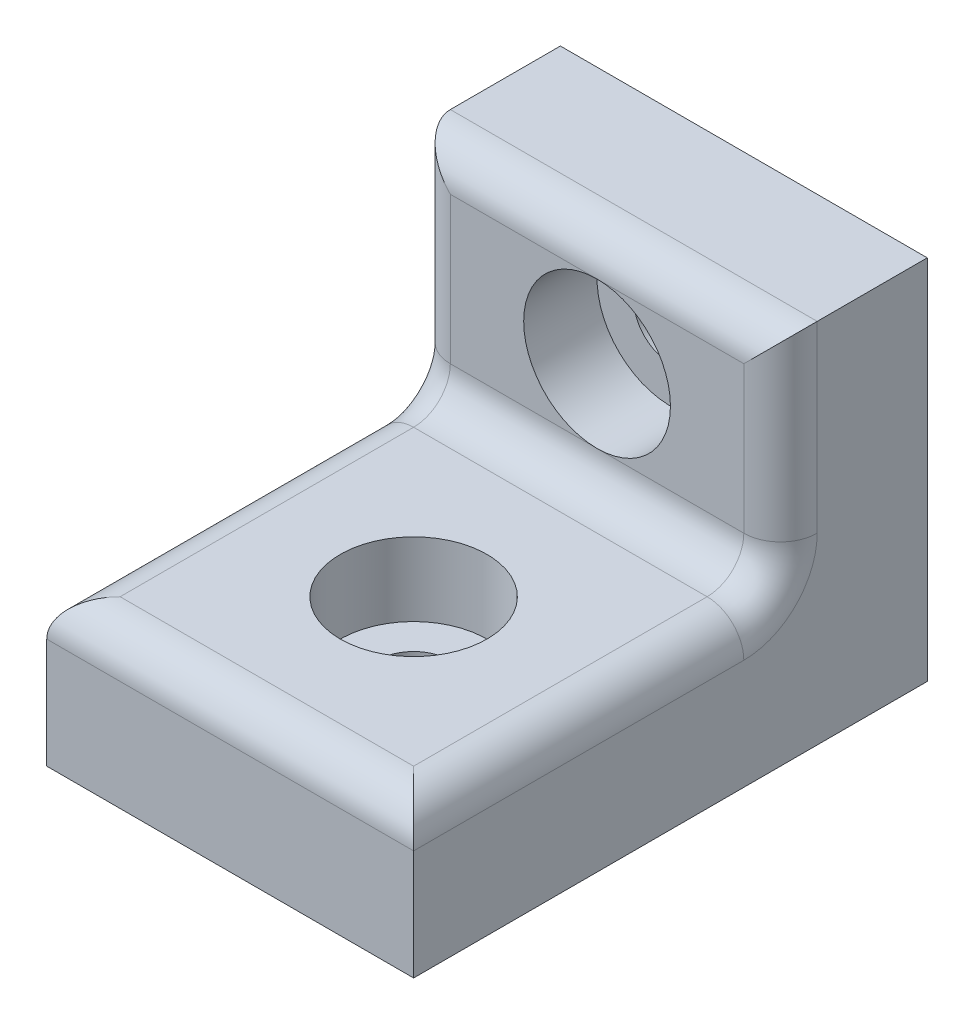
ISO-10303-21;
HEADER;
FILE_DESCRIPTION(('STEP AP214'),'2;1');
FILE_NAME('part.step','',(''),(''),'','','');
FILE_SCHEMA(('AUTOMOTIVE_DESIGN { 1 0 10303 214 1 1 1 1 }'));
ENDSEC;
DATA;
#1=APPLICATION_CONTEXT('core data for automotive mechanical design processes');
#2=APPLICATION_PROTOCOL_DEFINITION('international standard','automotive_design',2000,#1);
#3=PRODUCT_CONTEXT('',#1,'mechanical');
#4=PRODUCT('Part','Part','',(#3));
#5=PRODUCT_RELATED_PRODUCT_CATEGORY('part','',(#4));
#6=PRODUCT_DEFINITION_FORMATION('','',#4);
#7=PRODUCT_DEFINITION_CONTEXT('part definition',#1,'design');
#8=PRODUCT_DEFINITION('design','',#6,#7);
#9=PRODUCT_DEFINITION_SHAPE('','',#8);
#10=(LENGTH_UNIT() NAMED_UNIT(*) SI_UNIT(.MILLI.,.METRE.));
#11=(NAMED_UNIT(*) PLANE_ANGLE_UNIT() SI_UNIT($,.RADIAN.));
#12=(NAMED_UNIT(*) SI_UNIT($,.STERADIAN.) SOLID_ANGLE_UNIT());
#13=UNCERTAINTY_MEASURE_WITH_UNIT(LENGTH_MEASURE(1.E-05),#10,'distance_accuracy_value','');
#14=(GEOMETRIC_REPRESENTATION_CONTEXT(3) GLOBAL_UNCERTAINTY_ASSIGNED_CONTEXT((#13)) GLOBAL_UNIT_ASSIGNED_CONTEXT((#10,
#11,#12)) REPRESENTATION_CONTEXT('',''));
#15=CARTESIAN_POINT('',(0.,0.,0.));
#16=DIRECTION('',(0.,0.,1.));
#17=DIRECTION('',(1.,0.,0.));
#18=AXIS2_PLACEMENT_3D('',#15,#16,#17);
#19=CARTESIAN_POINT('',(0.,0.,9.));
#20=DIRECTION('',(0.,1.,0.));
#21=DIRECTION('',(0.,0.,1.));
#22=AXIS2_PLACEMENT_3D('',#19,#20,#21);
#23=CYLINDRICAL_SURFACE('',#22,1.);
#24=CARTESIAN_POINT('',(0.,0.,9.));
#25=DIRECTION('',(0.,1.,0.));
#26=DIRECTION('',(0.,0.,1.));
#27=AXIS2_PLACEMENT_3D('',#24,#25,#26);
#28=CIRCLE('',#27,1.);
#29=CARTESIAN_POINT('',(0.,0.,10.));
#30=VERTEX_POINT('',#29);
#31=EDGE_CURVE('E184',#30,#30,#28,.T.);
#32=ORIENTED_EDGE('',*,*,#31,.F.);
#33=EDGE_LOOP('',(#32));
#34=FACE_BOUND('',#33,.T.);
#35=CARTESIAN_POINT('',(0.,2.,9.));
#36=DIRECTION('',(0.,1.,0.));
#37=DIRECTION('',(0.,0.,1.));
#38=AXIS2_PLACEMENT_3D('',#35,#36,#37);
#39=CIRCLE('',#38,1.);
#40=CARTESIAN_POINT('',(0.,2.,10.));
#41=VERTEX_POINT('',#40);
#42=EDGE_CURVE('E41',#41,#41,#39,.F.);
#43=ORIENTED_EDGE('',*,*,#42,.F.);
#44=EDGE_LOOP('',(#43));
#45=FACE_BOUND('',#44,.T.);
#46=ADVANCED_FACE('F37',(#34,#45),#23,.F.);
#47=CARTESIAN_POINT('',(0.,0.,4.));
#48=DIRECTION('',(0.,0.,1.));
#49=DIRECTION('',(1.,0.,0.));
#50=AXIS2_PLACEMENT_3D('',#47,#48,#49);
#51=PLANE('',#50);
#52=CARTESIAN_POINT('',(0.,7.,4.));
#53=DIRECTION('',(0.,0.,1.));
#54=DIRECTION('',(1.,0.,0.));
#55=AXIS2_PLACEMENT_3D('',#52,#53,#54);
#56=CIRCLE('',#55,2.);
#57=CARTESIAN_POINT('',(0.,9.,4.));
#58=VERTEX_POINT('',#57);
#59=CARTESIAN_POINT('',(0.,5.,4.));
#60=VERTEX_POINT('',#59);
#61=EDGE_CURVE('E53',#58,#60,#56,.T.);
#62=ORIENTED_EDGE('',*,*,#61,.F.);
#63=DIRECTION('',(-1.,0.,0.));
#64=VECTOR('',#63,1.);
#65=CARTESIAN_POINT('',(-5.,9.,4.));
#66=LINE('',#65,#64);
#67=CARTESIAN_POINT('',(-4.,9.,4.));
#68=VERTEX_POINT('',#67);
#69=EDGE_CURVE('E135',#58,#68,#66,.T.);
#70=ORIENTED_EDGE('',*,*,#69,.T.);
#71=DIRECTION('',(0.,-1.,0.));
#72=VECTOR('',#71,1.);
#73=CARTESIAN_POINT('',(-4.,4.,4.));
#74=LINE('',#73,#72);
#75=CARTESIAN_POINT('',(-4.,5.,4.));
#76=VERTEX_POINT('',#75);
#77=EDGE_CURVE('E253',#68,#76,#74,.T.);
#78=ORIENTED_EDGE('',*,*,#77,.T.);
#79=DIRECTION('',(-1.,0.,0.));
#80=VECTOR('',#79,1.);
#81=CARTESIAN_POINT('',(0.,5.,4.));
#82=LINE('',#81,#80);
#83=EDGE_CURVE('E138',#76,#60,#82,.F.);
#84=ORIENTED_EDGE('',*,*,#83,.T.);
#85=EDGE_LOOP('',(#62,#70,#78,#84));
#86=FACE_BOUND('',#85,.T.);
#87=ADVANCED_FACE('F134',(#86),#51,.T.);
#88=CARTESIAN_POINT('',(0.,7.,0.));
#89=DIRECTION('',(0.,0.,1.));
#90=DIRECTION('',(1.,0.,0.));
#91=AXIS2_PLACEMENT_3D('',#88,#89,#90);
#92=CYLINDRICAL_SURFACE('',#91,1.);
#93=CARTESIAN_POINT('',(0.,7.,0.));
#94=DIRECTION('',(0.,0.,1.));
#95=DIRECTION('',(1.,0.,0.));
#96=AXIS2_PLACEMENT_3D('',#93,#94,#95);
#97=CIRCLE('',#96,1.);
#98=CARTESIAN_POINT('',(1.,7.,0.));
#99=VERTEX_POINT('',#98);
#100=EDGE_CURVE('E206',#99,#99,#97,.T.);
#101=ORIENTED_EDGE('',*,*,#100,.F.);
#102=EDGE_LOOP('',(#101));
#103=FACE_BOUND('',#102,.T.);
#104=CARTESIAN_POINT('',(0.,7.,2.));
#105=DIRECTION('',(0.,0.,1.));
#106=DIRECTION('',(1.,0.,0.));
#107=AXIS2_PLACEMENT_3D('',#104,#105,#106);
#108=CIRCLE('',#107,1.);
#109=CARTESIAN_POINT('',(1.,7.,2.));
#110=VERTEX_POINT('',#109);
#111=EDGE_CURVE('E207',#110,#110,#108,.F.);
#112=ORIENTED_EDGE('',*,*,#111,.F.);
#113=EDGE_LOOP('',(#112));
#114=FACE_BOUND('',#113,.T.);
#115=ADVANCED_FACE('F313',(#103,#114),#92,.F.);
#116=CARTESIAN_POINT('',(-5.,10.,4.));
#117=DIRECTION('',(1.,0.,0.));
#118=DIRECTION('',(0.,1.,0.));
#119=AXIS2_PLACEMENT_3D('',#116,#117,#118);
#120=PLANE('',#119);
#121=CARTESIAN_POINT('',(-5.,5.,5.));
#122=DIRECTION('',(1.,0.,0.));
#123=DIRECTION('',(0.,1.,0.));
#124=AXIS2_PLACEMENT_3D('',#121,#122,#123);
#125=CIRCLE('',#124,2.);
#126=CARTESIAN_POINT('',(-5.,5.,3.));
#127=VERTEX_POINT('',#126);
#128=CARTESIAN_POINT('',(-5.,3.,5.));
#129=VERTEX_POINT('',#128);
#130=EDGE_CURVE('E165',#127,#129,#125,.F.);
#131=ORIENTED_EDGE('',*,*,#130,.F.);
#132=DIRECTION('',(0.,-1.,0.));
#133=VECTOR('',#132,1.);
#134=CARTESIAN_POINT('',(-5.,10.,3.));
#135=LINE('',#134,#133);
#136=CARTESIAN_POINT('',(-5.,10.,3.));
#137=VERTEX_POINT('',#136);
#138=EDGE_CURVE('E170',#127,#137,#135,.F.);
#139=ORIENTED_EDGE('',*,*,#138,.T.);
#140=DIRECTION('',(0.,0.,-1.));
#141=VECTOR('',#140,1.);
#142=CARTESIAN_POINT('',(-5.,10.,4.));
#143=LINE('',#142,#141);
#144=CARTESIAN_POINT('',(-5.,10.,0.));
#145=VERTEX_POINT('',#144);
#146=EDGE_CURVE('E242',#137,#145,#143,.T.);
#147=ORIENTED_EDGE('',*,*,#146,.T.);
#148=DIRECTION('',(0.,-1.,0.));
#149=VECTOR('',#148,1.);
#150=CARTESIAN_POINT('',(-5.,10.,0.));
#151=LINE('',#150,#149);
#152=CARTESIAN_POINT('',(-5.,0.,0.));
#153=VERTEX_POINT('',#152);
#154=EDGE_CURVE('E231',#145,#153,#151,.T.);
#155=ORIENTED_EDGE('',*,*,#154,.T.);
#156=DIRECTION('',(0.,0.,-1.));
#157=VECTOR('',#156,1.);
#158=CARTESIAN_POINT('',(-5.,0.,4.));
#159=LINE('',#158,#157);
#160=CARTESIAN_POINT('',(-5.,0.,14.));
#161=VERTEX_POINT('',#160);
#162=EDGE_CURVE('E249',#161,#153,#159,.T.);
#163=ORIENTED_EDGE('',*,*,#162,.F.);
#164=DIRECTION('',(0.,-1.,0.));
#165=VECTOR('',#164,1.);
#166=CARTESIAN_POINT('',(-5.,0.,14.));
#167=LINE('',#166,#165);
#168=CARTESIAN_POINT('',(-5.,3.,14.));
#169=VERTEX_POINT('',#168);
#170=EDGE_CURVE('E223',#169,#161,#167,.T.);
#171=ORIENTED_EDGE('',*,*,#170,.F.);
#172=DIRECTION('',(0.,0.,-1.));
#173=VECTOR('',#172,1.);
#174=CARTESIAN_POINT('',(-5.,3.,4.));
#175=LINE('',#174,#173);
#176=EDGE_CURVE('E168',#169,#129,#175,.T.);
#177=ORIENTED_EDGE('',*,*,#176,.T.);
#178=EDGE_LOOP('',(#131,#139,#147,#155,#163,#171,#177));
#179=FACE_BOUND('',#178,.T.);
#180=ADVANCED_FACE('F286',(#179),#120,.F.);
#181=CARTESIAN_POINT('',(-5.,0.,4.));
#182=DIRECTION('',(0.,1.,0.));
#183=DIRECTION('',(0.,0.,1.));
#184=AXIS2_PLACEMENT_3D('',#181,#182,#183);
#185=PLANE('',#184);
#186=ORIENTED_EDGE('',*,*,#31,.T.);
#187=EDGE_LOOP('',(#186));
#188=FACE_BOUND('',#187,.T.);
#189=DIRECTION('',(1.,0.,0.));
#190=VECTOR('',#189,1.);
#191=CARTESIAN_POINT('',(-5.,0.,0.));
#192=LINE('',#191,#190);
#193=CARTESIAN_POINT('',(5.,0.,0.));
#194=VERTEX_POINT('',#193);
#195=EDGE_CURVE('E234',#153,#194,#192,.T.);
#196=ORIENTED_EDGE('',*,*,#195,.T.);
#197=DIRECTION('',(0.,0.,-1.));
#198=VECTOR('',#197,1.);
#199=CARTESIAN_POINT('',(5.,0.,4.));
#200=LINE('',#199,#198);
#201=CARTESIAN_POINT('',(5.,0.,14.));
#202=VERTEX_POINT('',#201);
#203=EDGE_CURVE('E246',#202,#194,#200,.T.);
#204=ORIENTED_EDGE('',*,*,#203,.F.);
#205=DIRECTION('',(1.,0.,0.));
#206=VECTOR('',#205,1.);
#207=CARTESIAN_POINT('',(-5.,0.,14.));
#208=LINE('',#207,#206);
#209=EDGE_CURVE('E225',#161,#202,#208,.T.);
#210=ORIENTED_EDGE('',*,*,#209,.F.);
#211=ORIENTED_EDGE('',*,*,#162,.T.);
#212=EDGE_LOOP('',(#196,#204,#210,#211));
#213=FACE_BOUND('',#212,.T.);
#214=ADVANCED_FACE('F304',(#188,#213),#185,.F.);
#215=CARTESIAN_POINT('',(5.,10.,4.));
#216=DIRECTION('',(-1.,0.,0.));
#217=DIRECTION('',(0.,-1.,0.));
#218=AXIS2_PLACEMENT_3D('',#215,#216,#217);
#219=PLANE('',#218);
#220=DIRECTION('',(0.,0.,-1.));
#221=VECTOR('',#220,1.);
#222=CARTESIAN_POINT('',(5.,10.,4.));
#223=LINE('',#222,#221);
#224=CARTESIAN_POINT('',(5.,10.,3.));
#225=VERTEX_POINT('',#224);
#226=CARTESIAN_POINT('',(5.,10.,0.));
#227=VERTEX_POINT('',#226);
#228=EDGE_CURVE('E244',#225,#227,#223,.T.);
#229=ORIENTED_EDGE('',*,*,#228,.F.);
#230=DIRECTION('',(0.,1.,0.));
#231=VECTOR('',#230,1.);
#232=CARTESIAN_POINT('',(5.,4.,3.));
#233=LINE('',#232,#231);
#234=CARTESIAN_POINT('',(5.,5.,3.));
#235=VERTEX_POINT('',#234);
#236=EDGE_CURVE('E162',#225,#235,#233,.F.);
#237=ORIENTED_EDGE('',*,*,#236,.T.);
#238=CARTESIAN_POINT('',(5.,5.,5.));
#239=DIRECTION('',(-1.,0.,0.));
#240=DIRECTION('',(0.,-1.,0.));
#241=AXIS2_PLACEMENT_3D('',#238,#239,#240);
#242=CIRCLE('',#241,2.);
#243=CARTESIAN_POINT('',(5.,3.,5.));
#244=VERTEX_POINT('',#243);
#245=EDGE_CURVE('E155',#244,#235,#242,.F.);
#246=ORIENTED_EDGE('',*,*,#245,.F.);
#247=DIRECTION('',(0.,0.,-1.));
#248=VECTOR('',#247,1.);
#249=CARTESIAN_POINT('',(5.,3.,4.));
#250=LINE('',#249,#248);
#251=CARTESIAN_POINT('',(5.,3.,14.));
#252=VERTEX_POINT('',#251);
#253=EDGE_CURVE('E154',#244,#252,#250,.F.);
#254=ORIENTED_EDGE('',*,*,#253,.T.);
#255=DIRECTION('',(0.,1.,0.));
#256=VECTOR('',#255,1.);
#257=CARTESIAN_POINT('',(5.,0.,14.));
#258=LINE('',#257,#256);
#259=EDGE_CURVE('E228',#202,#252,#258,.T.);
#260=ORIENTED_EDGE('',*,*,#259,.F.);
#261=ORIENTED_EDGE('',*,*,#203,.T.);
#262=DIRECTION('',(0.,1.,0.));
#263=VECTOR('',#262,1.);
#264=CARTESIAN_POINT('',(5.,10.,0.));
#265=LINE('',#264,#263);
#266=EDGE_CURVE('E236',#194,#227,#265,.T.);
#267=ORIENTED_EDGE('',*,*,#266,.T.);
#268=EDGE_LOOP('',(#229,#237,#246,#254,#260,#261,#267));
#269=FACE_BOUND('',#268,.T.);
#270=ADVANCED_FACE('F277',(#269),#219,.F.);
#271=CARTESIAN_POINT('',(-5.,10.,4.));
#272=DIRECTION('',(0.,-1.,0.));
#273=DIRECTION('',(0.,0.,-1.));
#274=AXIS2_PLACEMENT_3D('',#271,#272,#273);
#275=PLANE('',#274);
#276=ORIENTED_EDGE('',*,*,#146,.F.);
#277=DIRECTION('',(-1.,0.,0.));
#278=VECTOR('',#277,1.);
#279=CARTESIAN_POINT('',(5.,10.,3.));
#280=LINE('',#279,#278);
#281=EDGE_CURVE('E12',#137,#225,#280,.F.);
#282=ORIENTED_EDGE('',*,*,#281,.T.);
#283=ORIENTED_EDGE('',*,*,#228,.T.);
#284=DIRECTION('',(-1.,0.,0.));
#285=VECTOR('',#284,1.);
#286=CARTESIAN_POINT('',(-5.,10.,0.));
#287=LINE('',#286,#285);
#288=EDGE_CURVE('E239',#227,#145,#287,.T.);
#289=ORIENTED_EDGE('',*,*,#288,.T.);
#290=EDGE_LOOP('',(#276,#282,#283,#289));
#291=FACE_BOUND('',#290,.T.);
#292=ADVANCED_FACE('F275',(#291),#275,.F.);
#293=EDGE_CURVE('E125',#60,#58,#56,.T.);
#294=ORIENTED_EDGE('',*,*,#293,.F.);
#295=CARTESIAN_POINT('',(4.,5.,4.));
#296=VERTEX_POINT('',#295);
#297=EDGE_CURVE('E252',#60,#296,#82,.F.);
#298=ORIENTED_EDGE('',*,*,#297,.T.);
#299=DIRECTION('',(0.,1.,0.));
#300=VECTOR('',#299,1.);
#301=CARTESIAN_POINT('',(4.,10.,4.));
#302=LINE('',#301,#300);
#303=CARTESIAN_POINT('',(4.,9.,4.));
#304=VERTEX_POINT('',#303);
#305=EDGE_CURVE('E150',#296,#304,#302,.T.);
#306=ORIENTED_EDGE('',*,*,#305,.T.);
#307=EDGE_CURVE('E145',#304,#58,#66,.T.);
#308=ORIENTED_EDGE('',*,*,#307,.T.);
#309=EDGE_LOOP('',(#294,#298,#306,#308));
#310=FACE_BOUND('',#309,.T.);
#311=ADVANCED_FACE('F152',(#310),#51,.T.);
#312=CARTESIAN_POINT('',(0.,0.,0.));
#313=DIRECTION('',(0.,0.,1.));
#314=DIRECTION('',(1.,0.,0.));
#315=AXIS2_PLACEMENT_3D('',#312,#313,#314);
#316=PLANE('',#315);
#317=ORIENTED_EDGE('',*,*,#100,.T.);
#318=EDGE_LOOP('',(#317));
#319=FACE_BOUND('',#318,.T.);
#320=ORIENTED_EDGE('',*,*,#154,.F.);
#321=ORIENTED_EDGE('',*,*,#288,.F.);
#322=ORIENTED_EDGE('',*,*,#266,.F.);
#323=ORIENTED_EDGE('',*,*,#195,.F.);
#324=EDGE_LOOP('',(#320,#321,#322,#323));
#325=FACE_BOUND('',#324,.T.);
#326=ADVANCED_FACE('F283',(#319,#325),#316,.F.);
#327=CARTESIAN_POINT('',(-5.,4.,14.));
#328=DIRECTION('',(0.,-1.,0.));
#329=DIRECTION('',(0.,0.,-1.));
#330=AXIS2_PLACEMENT_3D('',#327,#328,#329);
#331=PLANE('',#330);
#332=CARTESIAN_POINT('',(0.,4.,9.));
#333=DIRECTION('',(0.,1.,0.));
#334=DIRECTION('',(0.,0.,1.));
#335=AXIS2_PLACEMENT_3D('',#332,#333,#334);
#336=CIRCLE('',#335,2.);
#337=CARTESIAN_POINT('',(0.,4.,11.));
#338=VERTEX_POINT('',#337);
#339=EDGE_CURVE('E218',#338,#338,#336,.T.);
#340=ORIENTED_EDGE('',*,*,#339,.F.);
#341=EDGE_LOOP('',(#340));
#342=FACE_BOUND('',#341,.T.);
#343=DIRECTION('',(0.,0.,-1.));
#344=VECTOR('',#343,1.);
#345=CARTESIAN_POINT('',(-4.,4.,14.));
#346=LINE('',#345,#344);
#347=CARTESIAN_POINT('',(-4.,4.,5.));
#348=VERTEX_POINT('',#347);
#349=CARTESIAN_POINT('',(-4.,4.,13.));
#350=VERTEX_POINT('',#349);
#351=EDGE_CURVE('E176',#348,#350,#346,.F.);
#352=ORIENTED_EDGE('',*,*,#351,.T.);
#353=DIRECTION('',(-1.,0.,0.));
#354=VECTOR('',#353,1.);
#355=CARTESIAN_POINT('',(-5.,4.,13.));
#356=LINE('',#355,#354);
#357=CARTESIAN_POINT('',(4.,4.,13.));
#358=VERTEX_POINT('',#357);
#359=EDGE_CURVE('E46',#350,#358,#356,.F.);
#360=ORIENTED_EDGE('',*,*,#359,.T.);
#361=DIRECTION('',(0.,0.,-1.));
#362=VECTOR('',#361,1.);
#363=CARTESIAN_POINT('',(4.,4.,14.));
#364=LINE('',#363,#362);
#365=CARTESIAN_POINT('',(4.,4.,5.));
#366=VERTEX_POINT('',#365);
#367=EDGE_CURVE('E61',#358,#366,#364,.T.);
#368=ORIENTED_EDGE('',*,*,#367,.T.);
#369=DIRECTION('',(-1.,0.,0.));
#370=VECTOR('',#369,1.);
#371=CARTESIAN_POINT('',(-5.,4.,5.));
#372=LINE('',#371,#370);
#373=EDGE_CURVE('E174',#366,#348,#372,.T.);
#374=ORIENTED_EDGE('',*,*,#373,.T.);
#375=EDGE_LOOP('',(#352,#360,#368,#374));
#376=FACE_BOUND('',#375,.T.);
#377=ADVANCED_FACE('F295',(#342,#376),#331,.F.);
#378=CARTESIAN_POINT('',(0.,0.,14.));
#379=DIRECTION('',(0.,0.,-1.));
#380=DIRECTION('',(-1.,0.,0.));
#381=AXIS2_PLACEMENT_3D('',#378,#379,#380);
#382=PLANE('',#381);
#383=ORIENTED_EDGE('',*,*,#259,.T.);
#384=DIRECTION('',(-1.,0.,0.));
#385=VECTOR('',#384,1.);
#386=CARTESIAN_POINT('',(0.,3.,14.));
#387=LINE('',#386,#385);
#388=EDGE_CURVE('E172',#252,#169,#387,.T.);
#389=ORIENTED_EDGE('',*,*,#388,.T.);
#390=ORIENTED_EDGE('',*,*,#170,.T.);
#391=ORIENTED_EDGE('',*,*,#209,.T.);
#392=EDGE_LOOP('',(#383,#389,#390,#391));
#393=FACE_BOUND('',#392,.T.);
#394=ADVANCED_FACE('F302',(#393),#382,.F.);
#395=CARTESIAN_POINT('',(-4.,3.,4.));
#396=DIRECTION('',(0.,0.,-1.));
#397=DIRECTION('',(-1.,0.,0.));
#398=AXIS2_PLACEMENT_3D('',#395,#396,#397);
#399=CYLINDRICAL_SURFACE('',#398,1.);
#400=CARTESIAN_POINT('',(-4.,3.,5.));
#401=DIRECTION('',(0.,0.,-1.));
#402=DIRECTION('',(-1.,0.,0.));
#403=AXIS2_PLACEMENT_3D('',#400,#401,#402);
#404=CIRCLE('',#403,1.);
#405=EDGE_CURVE('E201',#129,#348,#404,.T.);
#406=ORIENTED_EDGE('',*,*,#405,.F.);
#407=ORIENTED_EDGE('',*,*,#176,.F.);
#408=CARTESIAN_POINT('',(-4.,3.,13.));
#409=DIRECTION('',(-0.707106781186547,0.,-0.707106781186547));
#410=DIRECTION('',(0.707106781186547,0.,-0.707106781186547));
#411=AXIS2_PLACEMENT_3D('',#408,#409,#410);
#412=ELLIPSE('',#411,1.41421356237309,1.);
#413=EDGE_CURVE('E204',#350,#169,#412,.F.);
#414=ORIENTED_EDGE('',*,*,#413,.F.);
#415=ORIENTED_EDGE('',*,*,#351,.F.);
#416=EDGE_LOOP('',(#406,#407,#414,#415));
#417=FACE_BOUND('',#416,.T.);
#418=ADVANCED_FACE('F39',(#417),#399,.T.);
#419=CARTESIAN_POINT('',(0.,3.,13.));
#420=DIRECTION('',(-1.,0.,0.));
#421=DIRECTION('',(0.,0.,1.));
#422=AXIS2_PLACEMENT_3D('',#419,#420,#421);
#423=CYLINDRICAL_SURFACE('',#422,1.);
#424=ORIENTED_EDGE('',*,*,#413,.T.);
#425=ORIENTED_EDGE('',*,*,#388,.F.);
#426=CARTESIAN_POINT('',(4.,3.,13.));
#427=DIRECTION('',(0.707106781186547,0.,-0.707106781186547));
#428=DIRECTION('',(-0.707106781186547,0.,-0.707106781186547));
#429=AXIS2_PLACEMENT_3D('',#426,#427,#428);
#430=ELLIPSE('',#429,1.41421356237309,1.);
#431=EDGE_CURVE('E199',#358,#252,#430,.T.);
#432=ORIENTED_EDGE('',*,*,#431,.F.);
#433=ORIENTED_EDGE('',*,*,#359,.F.);
#434=EDGE_LOOP('',(#424,#425,#432,#433));
#435=FACE_BOUND('',#434,.T.);
#436=ADVANCED_FACE('F297',(#435),#423,.T.);
#437=CARTESIAN_POINT('',(-4.,5.,5.));
#438=DIRECTION('',(1.,0.,0.));
#439=DIRECTION('',(0.,1.,0.));
#440=AXIS2_PLACEMENT_3D('',#437,#438,#439);
#441=TOROIDAL_SURFACE('',#440,2.,1.);
#442=ORIENTED_EDGE('',*,*,#130,.T.);
#443=ORIENTED_EDGE('',*,*,#405,.T.);
#444=CARTESIAN_POINT('',(-4.,5.,5.));
#445=DIRECTION('',(1.,0.,0.));
#446=DIRECTION('',(0.,1.,0.));
#447=AXIS2_PLACEMENT_3D('',#444,#445,#446);
#448=CIRCLE('',#447,1.);
#449=EDGE_CURVE('E196',#76,#348,#448,.F.);
#450=ORIENTED_EDGE('',*,*,#449,.F.);
#451=CARTESIAN_POINT('',(-4.,5.,3.));
#452=DIRECTION('',(0.,-1.,0.));
#453=DIRECTION('',(0.,0.,-1.));
#454=AXIS2_PLACEMENT_3D('',#451,#452,#453);
#455=CIRCLE('',#454,1.);
#456=EDGE_CURVE('E193',#127,#76,#455,.F.);
#457=ORIENTED_EDGE('',*,*,#456,.F.);
#458=EDGE_LOOP('',(#442,#443,#450,#457));
#459=FACE_BOUND('',#458,.T.);
#460=ADVANCED_FACE('F260',(#459),#441,.T.);
#461=CARTESIAN_POINT('',(4.,3.,14.));
#462=DIRECTION('',(0.,0.,-1.));
#463=DIRECTION('',(-1.,0.,0.));
#464=AXIS2_PLACEMENT_3D('',#461,#462,#463);
#465=CYLINDRICAL_SURFACE('',#464,1.);
#466=ORIENTED_EDGE('',*,*,#431,.T.);
#467=ORIENTED_EDGE('',*,*,#253,.F.);
#468=CARTESIAN_POINT('',(4.,3.,5.));
#469=DIRECTION('',(0.,0.,-1.));
#470=DIRECTION('',(-1.,0.,0.));
#471=AXIS2_PLACEMENT_3D('',#468,#469,#470);
#472=CIRCLE('',#471,1.);
#473=EDGE_CURVE('E190',#366,#244,#472,.T.);
#474=ORIENTED_EDGE('',*,*,#473,.F.);
#475=ORIENTED_EDGE('',*,*,#367,.F.);
#476=EDGE_LOOP('',(#466,#467,#474,#475));
#477=FACE_BOUND('',#476,.T.);
#478=ADVANCED_FACE('F300',(#477),#465,.T.);
#479=CARTESIAN_POINT('',(-5.,5.,5.));
#480=DIRECTION('',(-1.,0.,0.));
#481=DIRECTION('',(0.,0.,1.));
#482=AXIS2_PLACEMENT_3D('',#479,#480,#481);
#483=CYLINDRICAL_SURFACE('',#482,1.);
#484=ORIENTED_EDGE('',*,*,#449,.T.);
#485=ORIENTED_EDGE('',*,*,#373,.F.);
#486=CARTESIAN_POINT('',(4.,5.,5.));
#487=DIRECTION('',(-1.,0.,0.));
#488=DIRECTION('',(0.,-1.,0.));
#489=AXIS2_PLACEMENT_3D('',#486,#487,#488);
#490=CIRCLE('',#489,1.);
#491=EDGE_CURVE('E187',#296,#366,#490,.T.);
#492=ORIENTED_EDGE('',*,*,#491,.F.);
#493=ORIENTED_EDGE('',*,*,#297,.F.);
#494=ORIENTED_EDGE('',*,*,#83,.F.);
#495=EDGE_LOOP('',(#484,#485,#492,#493,#494));
#496=FACE_BOUND('',#495,.T.);
#497=ADVANCED_FACE('F264',(#496),#483,.F.);
#498=CARTESIAN_POINT('',(-4.,0.,3.));
#499=DIRECTION('',(0.,1.,0.));
#500=DIRECTION('',(-1.,0.,0.));
#501=AXIS2_PLACEMENT_3D('',#498,#499,#500);
#502=CYLINDRICAL_SURFACE('',#501,1.);
#503=ORIENTED_EDGE('',*,*,#456,.T.);
#504=ORIENTED_EDGE('',*,*,#77,.F.);
#505=CARTESIAN_POINT('',(-4.,9.,3.));
#506=DIRECTION('',(0.707106781186547,0.707106781186548,0.));
#507=DIRECTION('',(0.707106781186548,-0.707106781186547,0.));
#508=AXIS2_PLACEMENT_3D('',#505,#506,#507);
#509=ELLIPSE('',#508,1.4142135623731,1.);
#510=EDGE_CURVE('E149',#137,#68,#509,.T.);
#511=ORIENTED_EDGE('',*,*,#510,.F.);
#512=ORIENTED_EDGE('',*,*,#138,.F.);
#513=EDGE_LOOP('',(#503,#504,#511,#512));
#514=FACE_BOUND('',#513,.T.);
#515=ADVANCED_FACE('F258',(#514),#502,.T.);
#516=CARTESIAN_POINT('',(4.,5.,5.));
#517=DIRECTION('',(-1.,0.,0.));
#518=DIRECTION('',(0.,-1.,0.));
#519=AXIS2_PLACEMENT_3D('',#516,#517,#518);
#520=TOROIDAL_SURFACE('',#519,2.,1.);
#521=ORIENTED_EDGE('',*,*,#473,.T.);
#522=ORIENTED_EDGE('',*,*,#245,.T.);
#523=CARTESIAN_POINT('',(4.,5.,3.));
#524=DIRECTION('',(0.,-1.,0.));
#525=DIRECTION('',(0.,0.,-1.));
#526=AXIS2_PLACEMENT_3D('',#523,#524,#525);
#527=CIRCLE('',#526,1.);
#528=EDGE_CURVE('E183',#296,#235,#527,.F.);
#529=ORIENTED_EDGE('',*,*,#528,.F.);
#530=ORIENTED_EDGE('',*,*,#491,.T.);
#531=EDGE_LOOP('',(#521,#522,#529,#530));
#532=FACE_BOUND('',#531,.T.);
#533=ADVANCED_FACE('F268',(#532),#520,.T.);
#534=CARTESIAN_POINT('',(0.,9.,3.));
#535=DIRECTION('',(1.,0.,0.));
#536=DIRECTION('',(0.,0.,-1.));
#537=AXIS2_PLACEMENT_3D('',#534,#535,#536);
#538=CYLINDRICAL_SURFACE('',#537,1.);
#539=ORIENTED_EDGE('',*,*,#510,.T.);
#540=ORIENTED_EDGE('',*,*,#69,.F.);
#541=ORIENTED_EDGE('',*,*,#307,.F.);
#542=CARTESIAN_POINT('',(4.,9.,3.));
#543=DIRECTION('',(0.707106781186547,-0.707106781186547,0.));
#544=DIRECTION('',(0.707106781186547,0.707106781186548,0.));
#545=AXIS2_PLACEMENT_3D('',#542,#543,#544);
#546=ELLIPSE('',#545,1.41421356237309,1.);
#547=EDGE_CURVE('E181',#225,#304,#546,.T.);
#548=ORIENTED_EDGE('',*,*,#547,.F.);
#549=ORIENTED_EDGE('',*,*,#281,.F.);
#550=EDGE_LOOP('',(#539,#540,#541,#548,#549));
#551=FACE_BOUND('',#550,.T.);
#552=ADVANCED_FACE('F143',(#551),#538,.T.);
#553=CARTESIAN_POINT('',(4.,0.,3.));
#554=DIRECTION('',(0.,-1.,0.));
#555=DIRECTION('',(1.,0.,0.));
#556=AXIS2_PLACEMENT_3D('',#553,#554,#555);
#557=CYLINDRICAL_SURFACE('',#556,1.);
#558=ORIENTED_EDGE('',*,*,#528,.T.);
#559=ORIENTED_EDGE('',*,*,#236,.F.);
#560=ORIENTED_EDGE('',*,*,#547,.T.);
#561=ORIENTED_EDGE('',*,*,#305,.F.);
#562=EDGE_LOOP('',(#558,#559,#560,#561));
#563=FACE_BOUND('',#562,.T.);
#564=ADVANCED_FACE('F271',(#563),#557,.T.);
#565=CARTESIAN_POINT('',(0.,7.,2.));
#566=DIRECTION('',(0.,0.,1.));
#567=DIRECTION('',(1.,0.,0.));
#568=AXIS2_PLACEMENT_3D('',#565,#566,#567);
#569=PLANE('',#568);
#570=CARTESIAN_POINT('',(0.,7.,2.));
#571=DIRECTION('',(0.,0.,1.));
#572=DIRECTION('',(1.,0.,0.));
#573=AXIS2_PLACEMENT_3D('',#570,#571,#572);
#574=CIRCLE('',#573,2.);
#575=CARTESIAN_POINT('',(2.,7.,2.));
#576=VERTEX_POINT('',#575);
#577=EDGE_CURVE('E139',#576,#576,#574,.T.);
#578=ORIENTED_EDGE('',*,*,#577,.T.);
#579=EDGE_LOOP('',(#578));
#580=FACE_BOUND('',#579,.T.);
#581=ORIENTED_EDGE('',*,*,#111,.T.);
#582=EDGE_LOOP('',(#581));
#583=FACE_BOUND('',#582,.T.);
#584=ADVANCED_FACE('F416',(#580,#583),#569,.T.);
#585=CARTESIAN_POINT('',(0.,7.,2.));
#586=DIRECTION('',(0.,0.,1.));
#587=DIRECTION('',(1.,0.,0.));
#588=AXIS2_PLACEMENT_3D('',#585,#586,#587);
#589=CYLINDRICAL_SURFACE('',#588,2.);
#590=ORIENTED_EDGE('',*,*,#577,.F.);
#591=EDGE_LOOP('',(#590));
#592=FACE_BOUND('',#591,.T.);
#593=ORIENTED_EDGE('',*,*,#61,.T.);
#594=ORIENTED_EDGE('',*,*,#293,.T.);
#595=EDGE_LOOP('',(#593,#594));
#596=FACE_BOUND('',#595,.T.);
#597=ADVANCED_FACE('F126',(#592,#596),#589,.F.);
#598=CARTESIAN_POINT('',(0.,2.,9.));
#599=DIRECTION('',(0.,1.,0.));
#600=DIRECTION('',(0.,0.,1.));
#601=AXIS2_PLACEMENT_3D('',#598,#599,#600);
#602=PLANE('',#601);
#603=CARTESIAN_POINT('',(0.,2.,9.));
#604=DIRECTION('',(0.,1.,0.));
#605=DIRECTION('',(0.,0.,1.));
#606=AXIS2_PLACEMENT_3D('',#603,#604,#605);
#607=CIRCLE('',#606,2.);
#608=CARTESIAN_POINT('',(0.,2.,11.));
#609=VERTEX_POINT('',#608);
#610=EDGE_CURVE('E524',#609,#609,#607,.T.);
#611=ORIENTED_EDGE('',*,*,#610,.T.);
#612=EDGE_LOOP('',(#611));
#613=FACE_BOUND('',#612,.T.);
#614=ORIENTED_EDGE('',*,*,#42,.T.);
#615=EDGE_LOOP('',(#614));
#616=FACE_BOUND('',#615,.T.);
#617=ADVANCED_FACE('F427',(#613,#616),#602,.T.);
#618=CARTESIAN_POINT('',(0.,2.,9.));
#619=DIRECTION('',(0.,1.,0.));
#620=DIRECTION('',(0.,0.,1.));
#621=AXIS2_PLACEMENT_3D('',#618,#619,#620);
#622=CYLINDRICAL_SURFACE('',#621,2.);
#623=ORIENTED_EDGE('',*,*,#610,.F.);
#624=EDGE_LOOP('',(#623));
#625=FACE_BOUND('',#624,.T.);
#626=ORIENTED_EDGE('',*,*,#339,.T.);
#627=EDGE_LOOP('',(#626));
#628=FACE_BOUND('',#627,.T.);
#629=ADVANCED_FACE('F433',(#625,#628),#622,.F.);
#630=CLOSED_SHELL('',(#46,#87,#115,#180,#214,#270,#292,#311,#326,#377,#394,#418,#436,#460,#478,
#497,#515,#533,#552,#564,#584,#597,#617,#629));
#631=MANIFOLD_SOLID_BREP('B2',#630);
#632=ADVANCED_BREP_SHAPE_REPRESENTATION('',(#18,#631),#14);
#633=SHAPE_DEFINITION_REPRESENTATION(#9,#632);
ENDSEC;
END-ISO-10303-21;
